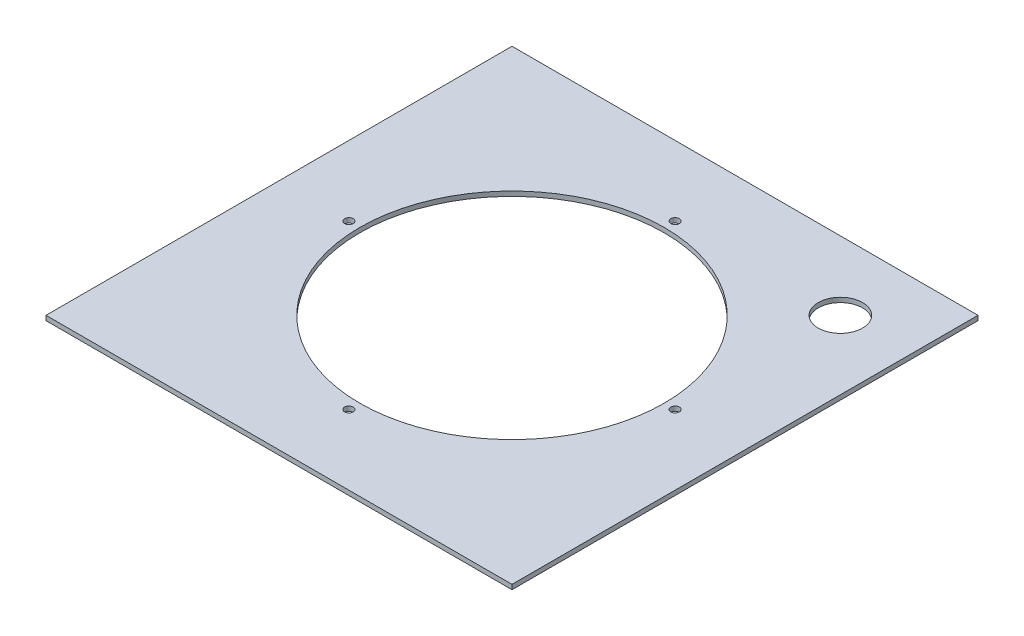
ISO-10303-21;
HEADER;
FILE_DESCRIPTION(('STEP AP214'),'2;1');
FILE_NAME('part.step','',(''),(''),'','','');
FILE_SCHEMA(('AUTOMOTIVE_DESIGN { 1 0 10303 214 1 1 1 1 }'));
ENDSEC;
DATA;
#1=APPLICATION_CONTEXT('core data for automotive mechanical design processes');
#2=APPLICATION_PROTOCOL_DEFINITION('international standard','automotive_design',2000,#1);
#3=PRODUCT_CONTEXT('',#1,'mechanical');
#4=PRODUCT('Part','Part','',(#3));
#5=PRODUCT_RELATED_PRODUCT_CATEGORY('part','',(#4));
#6=PRODUCT_DEFINITION_FORMATION('','',#4);
#7=PRODUCT_DEFINITION_CONTEXT('part definition',#1,'design');
#8=PRODUCT_DEFINITION('design','',#6,#7);
#9=PRODUCT_DEFINITION_SHAPE('','',#8);
#10=(LENGTH_UNIT() NAMED_UNIT(*) SI_UNIT(.MILLI.,.METRE.));
#11=(NAMED_UNIT(*) PLANE_ANGLE_UNIT() SI_UNIT($,.RADIAN.));
#12=(NAMED_UNIT(*) SI_UNIT($,.STERADIAN.) SOLID_ANGLE_UNIT());
#13=UNCERTAINTY_MEASURE_WITH_UNIT(LENGTH_MEASURE(1.E-05),#10,'distance_accuracy_value','');
#14=(GEOMETRIC_REPRESENTATION_CONTEXT(3) GLOBAL_UNCERTAINTY_ASSIGNED_CONTEXT((#13)) GLOBAL_UNIT_ASSIGNED_CONTEXT((#10,
#11,#12)) REPRESENTATION_CONTEXT('',''));
#15=CARTESIAN_POINT('',(0.,0.,0.));
#16=DIRECTION('',(0.,0.,1.));
#17=DIRECTION('',(1.,0.,0.));
#18=AXIS2_PLACEMENT_3D('',#15,#16,#17);
#19=CARTESIAN_POINT('',(0.,3.,0.));
#20=DIRECTION('',(1.,0.,0.));
#21=DIRECTION('',(0.,0.,-1.));
#22=AXIS2_PLACEMENT_3D('',#19,#20,#21);
#23=PLANE('',#22);
#24=DIRECTION('',(0.,0.,1.));
#25=VECTOR('',#24,1.);
#26=CARTESIAN_POINT('',(0.,0.,0.));
#27=LINE('',#26,#25);
#28=CARTESIAN_POINT('',(0.,0.,0.));
#29=VERTEX_POINT('',#28);
#30=CARTESIAN_POINT('',(0.,0.,300.));
#31=VERTEX_POINT('',#30);
#32=EDGE_CURVE('E104',#29,#31,#27,.T.);
#33=ORIENTED_EDGE('',*,*,#32,.T.);
#34=DIRECTION('',(0.,-1.,0.));
#35=VECTOR('',#34,1.);
#36=CARTESIAN_POINT('',(0.,3.,300.));
#37=LINE('',#36,#35);
#38=CARTESIAN_POINT('',(0.,3.,300.));
#39=VERTEX_POINT('',#38);
#40=EDGE_CURVE('E11',#39,#31,#37,.T.);
#41=ORIENTED_EDGE('',*,*,#40,.F.);
#42=DIRECTION('',(0.,0.,1.));
#43=VECTOR('',#42,1.);
#44=CARTESIAN_POINT('',(0.,3.,0.));
#45=LINE('',#44,#43);
#46=CARTESIAN_POINT('',(0.,3.,0.));
#47=VERTEX_POINT('',#46);
#48=EDGE_CURVE('E91',#47,#39,#45,.T.);
#49=ORIENTED_EDGE('',*,*,#48,.F.);
#50=DIRECTION('',(0.,-1.,0.));
#51=VECTOR('',#50,1.);
#52=CARTESIAN_POINT('',(0.,3.,0.));
#53=LINE('',#52,#51);
#54=EDGE_CURVE('E99',#47,#29,#53,.T.);
#55=ORIENTED_EDGE('',*,*,#54,.T.);
#56=EDGE_LOOP('',(#33,#41,#49,#55));
#57=FACE_BOUND('',#56,.T.);
#58=ADVANCED_FACE('F41',(#57),#23,.F.);
#59=CARTESIAN_POINT('',(0.,3.,300.));
#60=DIRECTION('',(0.,0.,-1.));
#61=DIRECTION('',(-1.,0.,0.));
#62=AXIS2_PLACEMENT_3D('',#59,#60,#61);
#63=PLANE('',#62);
#64=DIRECTION('',(1.,0.,0.));
#65=VECTOR('',#64,1.);
#66=CARTESIAN_POINT('',(0.,0.,300.));
#67=LINE('',#66,#65);
#68=CARTESIAN_POINT('',(300.,0.,300.));
#69=VERTEX_POINT('',#68);
#70=EDGE_CURVE('E98',#31,#69,#67,.T.);
#71=ORIENTED_EDGE('',*,*,#70,.T.);
#72=DIRECTION('',(0.,-1.,0.));
#73=VECTOR('',#72,1.);
#74=CARTESIAN_POINT('',(300.,3.,300.));
#75=LINE('',#74,#73);
#76=CARTESIAN_POINT('',(300.,3.,300.));
#77=VERTEX_POINT('',#76);
#78=EDGE_CURVE('E47',#77,#69,#75,.T.);
#79=ORIENTED_EDGE('',*,*,#78,.F.);
#80=DIRECTION('',(1.,0.,0.));
#81=VECTOR('',#80,1.);
#82=CARTESIAN_POINT('',(0.,3.,300.));
#83=LINE('',#82,#81);
#84=EDGE_CURVE('E89',#39,#77,#83,.T.);
#85=ORIENTED_EDGE('',*,*,#84,.F.);
#86=ORIENTED_EDGE('',*,*,#40,.T.);
#87=EDGE_LOOP('',(#71,#79,#85,#86));
#88=FACE_BOUND('',#87,.T.);
#89=ADVANCED_FACE('F92',(#88),#63,.F.);
#90=CARTESIAN_POINT('',(300.,3.,0.));
#91=DIRECTION('',(-1.,0.,0.));
#92=DIRECTION('',(0.,0.,1.));
#93=AXIS2_PLACEMENT_3D('',#90,#91,#92);
#94=PLANE('',#93);
#95=DIRECTION('',(0.,0.,-1.));
#96=VECTOR('',#95,1.);
#97=CARTESIAN_POINT('',(300.,0.,0.));
#98=LINE('',#97,#96);
#99=CARTESIAN_POINT('',(300.,0.,0.));
#100=VERTEX_POINT('',#99);
#101=EDGE_CURVE('E73',#69,#100,#98,.T.);
#102=ORIENTED_EDGE('',*,*,#101,.T.);
#103=DIRECTION('',(0.,-1.,0.));
#104=VECTOR('',#103,1.);
#105=CARTESIAN_POINT('',(300.,3.,0.));
#106=LINE('',#105,#104);
#107=CARTESIAN_POINT('',(300.,3.,0.));
#108=VERTEX_POINT('',#107);
#109=EDGE_CURVE('E97',#108,#100,#106,.T.);
#110=ORIENTED_EDGE('',*,*,#109,.F.);
#111=DIRECTION('',(0.,0.,-1.));
#112=VECTOR('',#111,1.);
#113=CARTESIAN_POINT('',(300.,3.,0.));
#114=LINE('',#113,#112);
#115=EDGE_CURVE('E86',#77,#108,#114,.T.);
#116=ORIENTED_EDGE('',*,*,#115,.F.);
#117=ORIENTED_EDGE('',*,*,#78,.T.);
#118=EDGE_LOOP('',(#102,#110,#116,#117));
#119=FACE_BOUND('',#118,.T.);
#120=ADVANCED_FACE('F96',(#119),#94,.F.);
#121=CARTESIAN_POINT('',(0.,3.,0.));
#122=DIRECTION('',(0.,0.,1.));
#123=DIRECTION('',(1.,0.,0.));
#124=AXIS2_PLACEMENT_3D('',#121,#122,#123);
#125=PLANE('',#124);
#126=DIRECTION('',(-1.,0.,0.));
#127=VECTOR('',#126,1.);
#128=CARTESIAN_POINT('',(0.,0.,0.));
#129=LINE('',#128,#127);
#130=EDGE_CURVE('E78',#100,#29,#129,.T.);
#131=ORIENTED_EDGE('',*,*,#130,.T.);
#132=ORIENTED_EDGE('',*,*,#54,.F.);
#133=DIRECTION('',(-1.,0.,0.));
#134=VECTOR('',#133,1.);
#135=CARTESIAN_POINT('',(0.,3.,0.));
#136=LINE('',#135,#134);
#137=EDGE_CURVE('E60',#108,#47,#136,.T.);
#138=ORIENTED_EDGE('',*,*,#137,.F.);
#139=ORIENTED_EDGE('',*,*,#109,.T.);
#140=EDGE_LOOP('',(#131,#132,#138,#139));
#141=FACE_BOUND('',#140,.T.);
#142=ADVANCED_FACE('F115',(#141),#125,.F.);
#143=CARTESIAN_POINT('',(0.,3.,0.));
#144=DIRECTION('',(0.,1.,0.));
#145=DIRECTION('',(0.,0.,1.));
#146=AXIS2_PLACEMENT_3D('',#143,#144,#145);
#147=PLANE('',#146);
#148=CARTESIAN_POINT('',(45.,3.,150.));
#149=DIRECTION('',(0.,1.,0.));
#150=DIRECTION('',(0.,0.,1.));
#151=AXIS2_PLACEMENT_3D('',#148,#149,#150);
#152=CIRCLE('',#151,2.75);
#153=CARTESIAN_POINT('',(45.,3.,152.75));
#154=VERTEX_POINT('',#153);
#155=EDGE_CURVE('E150',#154,#154,#152,.T.);
#156=ORIENTED_EDGE('',*,*,#155,.F.);
#157=EDGE_LOOP('',(#156));
#158=FACE_BOUND('',#157,.T.);
#159=CARTESIAN_POINT('',(150.,3.,44.9999999999999));
#160=DIRECTION('',(0.,1.,0.));
#161=DIRECTION('',(0.,0.,1.));
#162=AXIS2_PLACEMENT_3D('',#159,#160,#161);
#163=CIRCLE('',#162,2.75000000000001);
#164=CARTESIAN_POINT('',(150.,3.,47.75));
#165=VERTEX_POINT('',#164);
#166=EDGE_CURVE('E143',#165,#165,#163,.T.);
#167=ORIENTED_EDGE('',*,*,#166,.F.);
#168=EDGE_LOOP('',(#167));
#169=FACE_BOUND('',#168,.T.);
#170=CARTESIAN_POINT('',(255.,3.,150.));
#171=DIRECTION('',(0.,1.,0.));
#172=DIRECTION('',(0.,0.,1.));
#173=AXIS2_PLACEMENT_3D('',#170,#171,#172);
#174=CIRCLE('',#173,2.74999999999998);
#175=CARTESIAN_POINT('',(255.,3.,152.75));
#176=VERTEX_POINT('',#175);
#177=EDGE_CURVE('E138',#176,#176,#174,.T.);
#178=ORIENTED_EDGE('',*,*,#177,.F.);
#179=EDGE_LOOP('',(#178));
#180=FACE_BOUND('',#179,.T.);
#181=CARTESIAN_POINT('',(150.,3.,255.));
#182=DIRECTION('',(0.,1.,0.));
#183=DIRECTION('',(0.,0.,1.));
#184=AXIS2_PLACEMENT_3D('',#181,#182,#183);
#185=CIRCLE('',#184,2.75000000000001);
#186=CARTESIAN_POINT('',(150.,3.,257.75));
#187=VERTEX_POINT('',#186);
#188=EDGE_CURVE('E132',#187,#187,#185,.T.);
#189=ORIENTED_EDGE('',*,*,#188,.F.);
#190=EDGE_LOOP('',(#189));
#191=FACE_BOUND('',#190,.T.);
#192=CARTESIAN_POINT('',(255.712463787389,3.,44.2875362126112));
#193=DIRECTION('',(0.,1.,0.));
#194=DIRECTION('',(0.,0.,1.));
#195=AXIS2_PLACEMENT_3D('',#192,#193,#194);
#196=CIRCLE('',#195,14.255);
#197=CARTESIAN_POINT('',(255.712463787389,3.,58.5425362126112));
#198=VERTEX_POINT('',#197);
#199=EDGE_CURVE('E124',#198,#198,#196,.T.);
#200=ORIENTED_EDGE('',*,*,#199,.F.);
#201=EDGE_LOOP('',(#200));
#202=FACE_BOUND('',#201,.T.);
#203=CARTESIAN_POINT('',(150.,3.,150.));
#204=DIRECTION('',(0.,1.,0.));
#205=DIRECTION('',(0.,0.,1.));
#206=AXIS2_PLACEMENT_3D('',#203,#204,#205);
#207=CIRCLE('',#206,98.);
#208=CARTESIAN_POINT('',(150.,3.,248.));
#209=VERTEX_POINT('',#208);
#210=EDGE_CURVE('E119',#209,#209,#207,.T.);
#211=ORIENTED_EDGE('',*,*,#210,.F.);
#212=EDGE_LOOP('',(#211));
#213=FACE_BOUND('',#212,.T.);
#214=ORIENTED_EDGE('',*,*,#48,.T.);
#215=ORIENTED_EDGE('',*,*,#84,.T.);
#216=ORIENTED_EDGE('',*,*,#115,.T.);
#217=ORIENTED_EDGE('',*,*,#137,.T.);
#218=EDGE_LOOP('',(#214,#215,#216,#217));
#219=FACE_BOUND('',#218,.T.);
#220=ADVANCED_FACE('F87',(#158,#169,#180,#191,#202,#213,#219),#147,.T.);
#221=CARTESIAN_POINT('',(0.,0.,0.));
#222=DIRECTION('',(0.,1.,0.));
#223=DIRECTION('',(0.,0.,1.));
#224=AXIS2_PLACEMENT_3D('',#221,#222,#223);
#225=PLANE('',#224);
#226=CARTESIAN_POINT('',(45.,0.,150.));
#227=DIRECTION('',(0.,1.,0.));
#228=DIRECTION('',(0.,0.,1.));
#229=AXIS2_PLACEMENT_3D('',#226,#227,#228);
#230=CIRCLE('',#229,2.75);
#231=CARTESIAN_POINT('',(45.,0.,152.75));
#232=VERTEX_POINT('',#231);
#233=EDGE_CURVE('E128',#232,#232,#230,.T.);
#234=ORIENTED_EDGE('',*,*,#233,.T.);
#235=EDGE_LOOP('',(#234));
#236=FACE_BOUND('',#235,.T.);
#237=CARTESIAN_POINT('',(150.,0.,44.9999999999999));
#238=DIRECTION('',(0.,1.,0.));
#239=DIRECTION('',(0.,0.,1.));
#240=AXIS2_PLACEMENT_3D('',#237,#238,#239);
#241=CIRCLE('',#240,2.75000000000001);
#242=CARTESIAN_POINT('',(150.,0.,47.75));
#243=VERTEX_POINT('',#242);
#244=EDGE_CURVE('E145',#243,#243,#241,.T.);
#245=ORIENTED_EDGE('',*,*,#244,.T.);
#246=EDGE_LOOP('',(#245));
#247=FACE_BOUND('',#246,.T.);
#248=CARTESIAN_POINT('',(255.,0.,150.));
#249=DIRECTION('',(0.,1.,0.));
#250=DIRECTION('',(0.,0.,1.));
#251=AXIS2_PLACEMENT_3D('',#248,#249,#250);
#252=CIRCLE('',#251,2.74999999999998);
#253=CARTESIAN_POINT('',(255.,0.,152.75));
#254=VERTEX_POINT('',#253);
#255=EDGE_CURVE('E139',#254,#254,#252,.T.);
#256=ORIENTED_EDGE('',*,*,#255,.T.);
#257=EDGE_LOOP('',(#256));
#258=FACE_BOUND('',#257,.T.);
#259=CARTESIAN_POINT('',(150.,0.,255.));
#260=DIRECTION('',(0.,1.,0.));
#261=DIRECTION('',(0.,0.,1.));
#262=AXIS2_PLACEMENT_3D('',#259,#260,#261);
#263=CIRCLE('',#262,2.75000000000001);
#264=CARTESIAN_POINT('',(150.,0.,257.75));
#265=VERTEX_POINT('',#264);
#266=EDGE_CURVE('E127',#265,#265,#263,.T.);
#267=ORIENTED_EDGE('',*,*,#266,.T.);
#268=EDGE_LOOP('',(#267));
#269=FACE_BOUND('',#268,.T.);
#270=CARTESIAN_POINT('',(255.712463787389,0.,44.2875362126112));
#271=DIRECTION('',(0.,1.,0.));
#272=DIRECTION('',(0.,0.,1.));
#273=AXIS2_PLACEMENT_3D('',#270,#271,#272);
#274=CIRCLE('',#273,14.255);
#275=CARTESIAN_POINT('',(255.712463787389,0.,58.5425362126112));
#276=VERTEX_POINT('',#275);
#277=EDGE_CURVE('E129',#276,#276,#274,.F.);
#278=ORIENTED_EDGE('',*,*,#277,.F.);
#279=EDGE_LOOP('',(#278));
#280=FACE_BOUND('',#279,.T.);
#281=CARTESIAN_POINT('',(150.,0.,150.));
#282=DIRECTION('',(0.,1.,0.));
#283=DIRECTION('',(0.,0.,1.));
#284=AXIS2_PLACEMENT_3D('',#281,#282,#283);
#285=CIRCLE('',#284,98.);
#286=CARTESIAN_POINT('',(150.,0.,248.));
#287=VERTEX_POINT('',#286);
#288=EDGE_CURVE('E110',#287,#287,#285,.F.);
#289=ORIENTED_EDGE('',*,*,#288,.F.);
#290=EDGE_LOOP('',(#289));
#291=FACE_BOUND('',#290,.T.);
#292=ORIENTED_EDGE('',*,*,#32,.F.);
#293=ORIENTED_EDGE('',*,*,#130,.F.);
#294=ORIENTED_EDGE('',*,*,#101,.F.);
#295=ORIENTED_EDGE('',*,*,#70,.F.);
#296=EDGE_LOOP('',(#292,#293,#294,#295));
#297=FACE_BOUND('',#296,.T.);
#298=ADVANCED_FACE('F114',(#236,#247,#258,#269,#280,#291,#297),#225,.F.);
#299=CARTESIAN_POINT('',(150.,-0.00100000000000013,150.));
#300=DIRECTION('',(0.,1.,0.));
#301=DIRECTION('',(0.,0.,1.));
#302=AXIS2_PLACEMENT_3D('',#299,#300,#301);
#303=CYLINDRICAL_SURFACE('',#302,98.);
#304=ORIENTED_EDGE('',*,*,#210,.T.);
#305=EDGE_LOOP('',(#304));
#306=FACE_BOUND('',#305,.T.);
#307=ORIENTED_EDGE('',*,*,#288,.T.);
#308=EDGE_LOOP('',(#307));
#309=FACE_BOUND('',#308,.T.);
#310=ADVANCED_FACE('F176',(#306,#309),#303,.F.);
#311=CARTESIAN_POINT('',(255.712463787389,-0.00100000000000013,44.2875362126112));
#312=DIRECTION('',(0.,1.,0.));
#313=DIRECTION('',(0.,0.,1.));
#314=AXIS2_PLACEMENT_3D('',#311,#312,#313);
#315=CYLINDRICAL_SURFACE('',#314,14.255);
#316=ORIENTED_EDGE('',*,*,#199,.T.);
#317=EDGE_LOOP('',(#316));
#318=FACE_BOUND('',#317,.T.);
#319=ORIENTED_EDGE('',*,*,#277,.T.);
#320=EDGE_LOOP('',(#319));
#321=FACE_BOUND('',#320,.T.);
#322=ADVANCED_FACE('F177',(#318,#321),#315,.F.);
#323=CARTESIAN_POINT('',(150.,0.,255.));
#324=DIRECTION('',(0.,1.,0.));
#325=DIRECTION('',(0.,0.,1.));
#326=AXIS2_PLACEMENT_3D('',#323,#324,#325);
#327=CYLINDRICAL_SURFACE('',#326,2.75000000000001);
#328=ORIENTED_EDGE('',*,*,#266,.F.);
#329=EDGE_LOOP('',(#328));
#330=FACE_BOUND('',#329,.T.);
#331=ORIENTED_EDGE('',*,*,#188,.T.);
#332=EDGE_LOOP('',(#331));
#333=FACE_BOUND('',#332,.T.);
#334=ADVANCED_FACE('F213',(#330,#333),#327,.F.);
#335=CARTESIAN_POINT('',(255.,0.,150.));
#336=DIRECTION('',(0.,1.,0.));
#337=DIRECTION('',(0.,0.,1.));
#338=AXIS2_PLACEMENT_3D('',#335,#336,#337);
#339=CYLINDRICAL_SURFACE('',#338,2.74999999999998);
#340=ORIENTED_EDGE('',*,*,#255,.F.);
#341=EDGE_LOOP('',(#340));
#342=FACE_BOUND('',#341,.T.);
#343=ORIENTED_EDGE('',*,*,#177,.T.);
#344=EDGE_LOOP('',(#343));
#345=FACE_BOUND('',#344,.T.);
#346=ADVANCED_FACE('F232',(#342,#345),#339,.F.);
#347=CARTESIAN_POINT('',(150.,0.,44.9999999999999));
#348=DIRECTION('',(0.,1.,0.));
#349=DIRECTION('',(0.,0.,1.));
#350=AXIS2_PLACEMENT_3D('',#347,#348,#349);
#351=CYLINDRICAL_SURFACE('',#350,2.75000000000001);
#352=ORIENTED_EDGE('',*,*,#244,.F.);
#353=EDGE_LOOP('',(#352));
#354=FACE_BOUND('',#353,.T.);
#355=ORIENTED_EDGE('',*,*,#166,.T.);
#356=EDGE_LOOP('',(#355));
#357=FACE_BOUND('',#356,.T.);
#358=ADVANCED_FACE('F158',(#354,#357),#351,.F.);
#359=CARTESIAN_POINT('',(45.,0.,150.));
#360=DIRECTION('',(0.,1.,0.));
#361=DIRECTION('',(0.,0.,1.));
#362=AXIS2_PLACEMENT_3D('',#359,#360,#361);
#363=CYLINDRICAL_SURFACE('',#362,2.75);
#364=ORIENTED_EDGE('',*,*,#233,.F.);
#365=EDGE_LOOP('',(#364));
#366=FACE_BOUND('',#365,.T.);
#367=ORIENTED_EDGE('',*,*,#155,.T.);
#368=EDGE_LOOP('',(#367));
#369=FACE_BOUND('',#368,.T.);
#370=ADVANCED_FACE('F159',(#366,#369),#363,.F.);
#371=CLOSED_SHELL('',(#58,#89,#120,#142,#220,#298,#310,#322,#334,#346,#358,#370));
#372=MANIFOLD_SOLID_BREP('B2',#371);
#373=ADVANCED_BREP_SHAPE_REPRESENTATION('',(#18,#372),#14);
#374=SHAPE_DEFINITION_REPRESENTATION(#9,#373);
ENDSEC;
END-ISO-10303-21;
